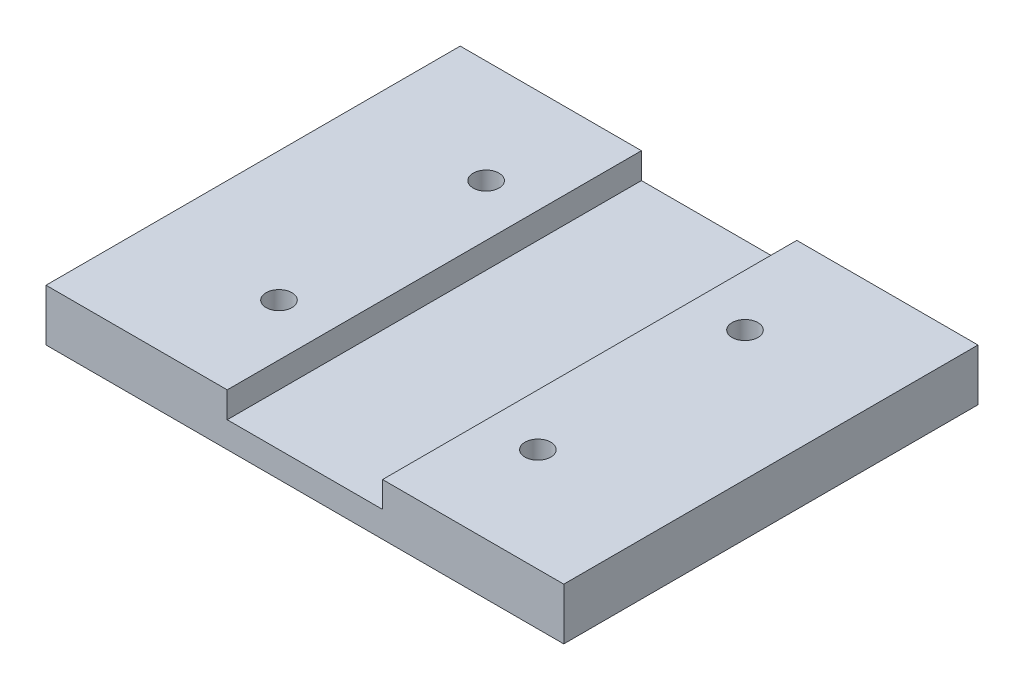
ISO-10303-21;
HEADER;
FILE_DESCRIPTION(('STEP AP214'),'2;1');
FILE_NAME('part.step','',(''),(''),'','','');
FILE_SCHEMA(('AUTOMOTIVE_DESIGN { 1 0 10303 214 1 1 1 1 }'));
ENDSEC;
DATA;
#1=APPLICATION_CONTEXT('core data for automotive mechanical design processes');
#2=APPLICATION_PROTOCOL_DEFINITION('international standard','automotive_design',2000,#1);
#3=PRODUCT_CONTEXT('',#1,'mechanical');
#4=PRODUCT('Part','Part','',(#3));
#5=PRODUCT_RELATED_PRODUCT_CATEGORY('part','',(#4));
#6=PRODUCT_DEFINITION_FORMATION('','',#4);
#7=PRODUCT_DEFINITION_CONTEXT('part definition',#1,'design');
#8=PRODUCT_DEFINITION('design','',#6,#7);
#9=PRODUCT_DEFINITION_SHAPE('','',#8);
#10=(LENGTH_UNIT() NAMED_UNIT(*) SI_UNIT(.MILLI.,.METRE.));
#11=(NAMED_UNIT(*) PLANE_ANGLE_UNIT() SI_UNIT($,.RADIAN.));
#12=(NAMED_UNIT(*) SI_UNIT($,.STERADIAN.) SOLID_ANGLE_UNIT());
#13=UNCERTAINTY_MEASURE_WITH_UNIT(LENGTH_MEASURE(1.E-05),#10,'distance_accuracy_value','');
#14=(GEOMETRIC_REPRESENTATION_CONTEXT(3) GLOBAL_UNCERTAINTY_ASSIGNED_CONTEXT((#13)) GLOBAL_UNIT_ASSIGNED_CONTEXT((#10,
#11,#12)) REPRESENTATION_CONTEXT('',''));
#15=CARTESIAN_POINT('',(0.,0.,0.));
#16=DIRECTION('',(0.,0.,1.));
#17=DIRECTION('',(1.,0.,0.));
#18=AXIS2_PLACEMENT_3D('',#15,#16,#17);
#19=CARTESIAN_POINT('',(0.,254.,0.));
#20=DIRECTION('',(0.,-1.,0.));
#21=DIRECTION('',(0.,0.,-1.));
#22=AXIS2_PLACEMENT_3D('',#19,#20,#21);
#23=PLANE('',#22);
#24=CARTESIAN_POINT('',(635.,254.,508.));
#25=DIRECTION('',(0.,1.,0.));
#26=DIRECTION('',(0.,0.,1.));
#27=AXIS2_PLACEMENT_3D('',#24,#25,#26);
#28=CIRCLE('',#27,63.5);
#29=CARTESIAN_POINT('',(635.,254.,571.5));
#30=VERTEX_POINT('',#29);
#31=EDGE_CURVE('E213',#30,#30,#28,.T.);
#32=ORIENTED_EDGE('',*,*,#31,.F.);
#33=EDGE_LOOP('',(#32));
#34=FACE_BOUND('',#33,.T.);
#35=DIRECTION('',(-1.,0.,0.));
#36=VECTOR('',#35,1.);
#37=CARTESIAN_POINT('',(-1270.,254.,-1016.));
#38=LINE('',#37,#36);
#39=CARTESIAN_POINT('',(1270.,254.,-1016.));
#40=VERTEX_POINT('',#39);
#41=CARTESIAN_POINT('',(381.,254.,-1016.));
#42=VERTEX_POINT('',#41);
#43=EDGE_CURVE('E98',#40,#42,#38,.T.);
#44=ORIENTED_EDGE('',*,*,#43,.T.);
#45=DIRECTION('',(0.,0.,1.));
#46=VECTOR('',#45,1.);
#47=CARTESIAN_POINT('',(381.,254.,-1016.));
#48=LINE('',#47,#46);
#49=CARTESIAN_POINT('',(381.,254.,1016.));
#50=VERTEX_POINT('',#49);
#51=EDGE_CURVE('E153',#42,#50,#48,.T.);
#52=ORIENTED_EDGE('',*,*,#51,.T.);
#53=DIRECTION('',(1.,0.,0.));
#54=VECTOR('',#53,1.);
#55=CARTESIAN_POINT('',(-1270.,254.,1016.));
#56=LINE('',#55,#54);
#57=CARTESIAN_POINT('',(1270.,254.,1016.));
#58=VERTEX_POINT('',#57);
#59=EDGE_CURVE('E69',#50,#58,#56,.T.);
#60=ORIENTED_EDGE('',*,*,#59,.T.);
#61=DIRECTION('',(0.,0.,-1.));
#62=VECTOR('',#61,1.);
#63=CARTESIAN_POINT('',(1270.,254.,1016.));
#64=LINE('',#63,#62);
#65=EDGE_CURVE('E156',#58,#40,#64,.T.);
#66=ORIENTED_EDGE('',*,*,#65,.T.);
#67=EDGE_LOOP('',(#44,#52,#60,#66));
#68=FACE_BOUND('',#67,.T.);
#69=CARTESIAN_POINT('',(635.,254.,-508.));
#70=DIRECTION('',(0.,1.,0.));
#71=DIRECTION('',(0.,0.,1.));
#72=AXIS2_PLACEMENT_3D('',#69,#70,#71);
#73=CIRCLE('',#72,63.5);
#74=CARTESIAN_POINT('',(635.,254.,-444.5));
#75=VERTEX_POINT('',#74);
#76=EDGE_CURVE('E222',#75,#75,#73,.T.);
#77=ORIENTED_EDGE('',*,*,#76,.F.);
#78=EDGE_LOOP('',(#77));
#79=FACE_BOUND('',#78,.T.);
#80=ADVANCED_FACE('F46',(#34,#68,#79),#23,.F.);
#81=CARTESIAN_POINT('',(0.,0.,0.));
#82=DIRECTION('',(0.,-1.,0.));
#83=DIRECTION('',(0.,0.,-1.));
#84=AXIS2_PLACEMENT_3D('',#81,#82,#83);
#85=PLANE('',#84);
#86=CARTESIAN_POINT('',(635.,0.,-508.));
#87=DIRECTION('',(0.,1.,0.));
#88=DIRECTION('',(0.,0.,1.));
#89=AXIS2_PLACEMENT_3D('',#86,#87,#88);
#90=CIRCLE('',#89,63.4999999999999);
#91=CARTESIAN_POINT('',(635.,0.,-444.5));
#92=VERTEX_POINT('',#91);
#93=EDGE_CURVE('E216',#92,#92,#90,.T.);
#94=ORIENTED_EDGE('',*,*,#93,.T.);
#95=EDGE_LOOP('',(#94));
#96=FACE_BOUND('',#95,.T.);
#97=CARTESIAN_POINT('',(635.,0.,508.));
#98=DIRECTION('',(0.,1.,0.));
#99=DIRECTION('',(0.,0.,1.));
#100=AXIS2_PLACEMENT_3D('',#97,#98,#99);
#101=CIRCLE('',#100,63.4999999999999);
#102=CARTESIAN_POINT('',(635.,0.,571.5));
#103=VERTEX_POINT('',#102);
#104=EDGE_CURVE('E215',#103,#103,#101,.T.);
#105=ORIENTED_EDGE('',*,*,#104,.T.);
#106=EDGE_LOOP('',(#105));
#107=FACE_BOUND('',#106,.T.);
#108=CARTESIAN_POINT('',(-635.,0.,508.));
#109=DIRECTION('',(0.,1.,0.));
#110=DIRECTION('',(0.,0.,1.));
#111=AXIS2_PLACEMENT_3D('',#108,#109,#110);
#112=CIRCLE('',#111,63.4999999999999);
#113=CARTESIAN_POINT('',(-635.,0.,571.5));
#114=VERTEX_POINT('',#113);
#115=EDGE_CURVE('E140',#114,#114,#112,.T.);
#116=ORIENTED_EDGE('',*,*,#115,.T.);
#117=EDGE_LOOP('',(#116));
#118=FACE_BOUND('',#117,.T.);
#119=DIRECTION('',(0.,0.,-1.));
#120=VECTOR('',#119,1.);
#121=CARTESIAN_POINT('',(1270.,0.,1016.));
#122=LINE('',#121,#120);
#123=CARTESIAN_POINT('',(1270.,0.,1016.));
#124=VERTEX_POINT('',#123);
#125=CARTESIAN_POINT('',(1270.,0.,-1016.));
#126=VERTEX_POINT('',#125);
#127=EDGE_CURVE('E152',#124,#126,#122,.T.);
#128=ORIENTED_EDGE('',*,*,#127,.F.);
#129=DIRECTION('',(1.,0.,0.));
#130=VECTOR('',#129,1.);
#131=CARTESIAN_POINT('',(-1270.,0.,1016.));
#132=LINE('',#131,#130);
#133=CARTESIAN_POINT('',(-1270.,0.,1016.));
#134=VERTEX_POINT('',#133);
#135=EDGE_CURVE('E91',#134,#124,#132,.T.);
#136=ORIENTED_EDGE('',*,*,#135,.F.);
#137=DIRECTION('',(0.,0.,1.));
#138=VECTOR('',#137,1.);
#139=CARTESIAN_POINT('',(-1270.,0.,1016.));
#140=LINE('',#139,#138);
#141=CARTESIAN_POINT('',(-1270.,0.,-1016.));
#142=VERTEX_POINT('',#141);
#143=EDGE_CURVE('E169',#142,#134,#140,.T.);
#144=ORIENTED_EDGE('',*,*,#143,.F.);
#145=DIRECTION('',(-1.,0.,0.));
#146=VECTOR('',#145,1.);
#147=CARTESIAN_POINT('',(-1270.,0.,-1016.));
#148=LINE('',#147,#146);
#149=EDGE_CURVE('E167',#126,#142,#148,.T.);
#150=ORIENTED_EDGE('',*,*,#149,.F.);
#151=EDGE_LOOP('',(#128,#136,#144,#150));
#152=FACE_BOUND('',#151,.T.);
#153=CARTESIAN_POINT('',(-635.,0.,-508.));
#154=DIRECTION('',(0.,1.,0.));
#155=DIRECTION('',(0.,0.,1.));
#156=AXIS2_PLACEMENT_3D('',#153,#154,#155);
#157=CIRCLE('',#156,63.4999999999999);
#158=CARTESIAN_POINT('',(-635.,0.,-444.5));
#159=VERTEX_POINT('',#158);
#160=EDGE_CURVE('E228',#159,#159,#157,.T.);
#161=ORIENTED_EDGE('',*,*,#160,.T.);
#162=EDGE_LOOP('',(#161));
#163=FACE_BOUND('',#162,.T.);
#164=ADVANCED_FACE('F184',(#96,#107,#118,#152,#163),#85,.T.);
#165=CARTESIAN_POINT('',(-635.,254.,-508.));
#166=DIRECTION('',(0.,1.,0.));
#167=DIRECTION('',(0.,0.,1.));
#168=AXIS2_PLACEMENT_3D('',#165,#166,#167);
#169=CIRCLE('',#168,63.5);
#170=CARTESIAN_POINT('',(-635.,254.,-444.5));
#171=VERTEX_POINT('',#170);
#172=EDGE_CURVE('E219',#171,#171,#169,.T.);
#173=ORIENTED_EDGE('',*,*,#172,.F.);
#174=EDGE_LOOP('',(#173));
#175=FACE_BOUND('',#174,.T.);
#176=CARTESIAN_POINT('',(-635.,254.,508.));
#177=DIRECTION('',(0.,1.,0.));
#178=DIRECTION('',(0.,0.,1.));
#179=AXIS2_PLACEMENT_3D('',#176,#177,#178);
#180=CIRCLE('',#179,63.5);
#181=CARTESIAN_POINT('',(-635.,254.,571.5));
#182=VERTEX_POINT('',#181);
#183=EDGE_CURVE('E231',#182,#182,#180,.T.);
#184=ORIENTED_EDGE('',*,*,#183,.F.);
#185=EDGE_LOOP('',(#184));
#186=FACE_BOUND('',#185,.T.);
#187=CARTESIAN_POINT('',(-1270.,254.,1016.));
#188=VERTEX_POINT('',#187);
#189=CARTESIAN_POINT('',(-381.,254.,1016.));
#190=VERTEX_POINT('',#189);
#191=EDGE_CURVE('E162',#188,#190,#56,.T.);
#192=ORIENTED_EDGE('',*,*,#191,.T.);
#193=DIRECTION('',(0.,0.,1.));
#194=VECTOR('',#193,1.);
#195=CARTESIAN_POINT('',(-381.,254.,-1016.));
#196=LINE('',#195,#194);
#197=CARTESIAN_POINT('',(-381.,254.,-1016.));
#198=VERTEX_POINT('',#197);
#199=EDGE_CURVE('E137',#198,#190,#196,.T.);
#200=ORIENTED_EDGE('',*,*,#199,.F.);
#201=CARTESIAN_POINT('',(-1270.,254.,-1016.));
#202=VERTEX_POINT('',#201);
#203=EDGE_CURVE('E158',#198,#202,#38,.T.);
#204=ORIENTED_EDGE('',*,*,#203,.T.);
#205=DIRECTION('',(0.,0.,1.));
#206=VECTOR('',#205,1.);
#207=CARTESIAN_POINT('',(-1270.,254.,1016.));
#208=LINE('',#207,#206);
#209=EDGE_CURVE('E160',#202,#188,#208,.T.);
#210=ORIENTED_EDGE('',*,*,#209,.T.);
#211=EDGE_LOOP('',(#192,#200,#204,#210));
#212=FACE_BOUND('',#211,.T.);
#213=ADVANCED_FACE('F194',(#175,#186,#212),#23,.F.);
#214=CARTESIAN_POINT('',(1270.,254.,1016.));
#215=DIRECTION('',(-1.,0.,0.));
#216=DIRECTION('',(0.,0.,1.));
#217=AXIS2_PLACEMENT_3D('',#214,#215,#216);
#218=PLANE('',#217);
#219=ORIENTED_EDGE('',*,*,#127,.T.);
#220=DIRECTION('',(0.,-1.,0.));
#221=VECTOR('',#220,1.);
#222=CARTESIAN_POINT('',(1270.,254.,-1016.));
#223=LINE('',#222,#221);
#224=EDGE_CURVE('E13',#40,#126,#223,.T.);
#225=ORIENTED_EDGE('',*,*,#224,.F.);
#226=ORIENTED_EDGE('',*,*,#65,.F.);
#227=DIRECTION('',(0.,-1.,0.));
#228=VECTOR('',#227,1.);
#229=CARTESIAN_POINT('',(1270.,254.,1016.));
#230=LINE('',#229,#228);
#231=EDGE_CURVE('E164',#58,#124,#230,.T.);
#232=ORIENTED_EDGE('',*,*,#231,.T.);
#233=EDGE_LOOP('',(#219,#225,#226,#232));
#234=FACE_BOUND('',#233,.T.);
#235=ADVANCED_FACE('F48',(#234),#218,.F.);
#236=CARTESIAN_POINT('',(-1270.,254.,-1016.));
#237=DIRECTION('',(0.,0.,1.));
#238=DIRECTION('',(1.,0.,0.));
#239=AXIS2_PLACEMENT_3D('',#236,#237,#238);
#240=PLANE('',#239);
#241=ORIENTED_EDGE('',*,*,#203,.F.);
#242=DIRECTION('',(0.,-1.,0.));
#243=VECTOR('',#242,1.);
#244=CARTESIAN_POINT('',(-381.,254.,-1016.));
#245=LINE('',#244,#243);
#246=CARTESIAN_POINT('',(-381.,127.,-1016.));
#247=VERTEX_POINT('',#246);
#248=EDGE_CURVE('E144',#198,#247,#245,.T.);
#249=ORIENTED_EDGE('',*,*,#248,.T.);
#250=DIRECTION('',(1.,0.,0.));
#251=VECTOR('',#250,1.);
#252=CARTESIAN_POINT('',(-381.,127.,-1016.));
#253=LINE('',#252,#251);
#254=CARTESIAN_POINT('',(381.,127.,-1016.));
#255=VERTEX_POINT('',#254);
#256=EDGE_CURVE('E127',#247,#255,#253,.T.);
#257=ORIENTED_EDGE('',*,*,#256,.T.);
#258=DIRECTION('',(0.,1.,0.));
#259=VECTOR('',#258,1.);
#260=CARTESIAN_POINT('',(381.,127.,-1016.));
#261=LINE('',#260,#259);
#262=EDGE_CURVE('E131',#255,#42,#261,.T.);
#263=ORIENTED_EDGE('',*,*,#262,.T.);
#264=ORIENTED_EDGE('',*,*,#43,.F.);
#265=ORIENTED_EDGE('',*,*,#224,.T.);
#266=ORIENTED_EDGE('',*,*,#149,.T.);
#267=DIRECTION('',(0.,-1.,0.));
#268=VECTOR('',#267,1.);
#269=CARTESIAN_POINT('',(-1270.,254.,-1016.));
#270=LINE('',#269,#268);
#271=EDGE_CURVE('E54',#202,#142,#270,.T.);
#272=ORIENTED_EDGE('',*,*,#271,.F.);
#273=EDGE_LOOP('',(#241,#249,#257,#263,#264,#265,#266,#272));
#274=FACE_BOUND('',#273,.T.);
#275=ADVANCED_FACE('F192',(#274),#240,.F.);
#276=CARTESIAN_POINT('',(-1270.,254.,1016.));
#277=DIRECTION('',(1.,0.,0.));
#278=DIRECTION('',(0.,0.,-1.));
#279=AXIS2_PLACEMENT_3D('',#276,#277,#278);
#280=PLANE('',#279);
#281=ORIENTED_EDGE('',*,*,#143,.T.);
#282=DIRECTION('',(0.,-1.,0.));
#283=VECTOR('',#282,1.);
#284=CARTESIAN_POINT('',(-1270.,254.,1016.));
#285=LINE('',#284,#283);
#286=EDGE_CURVE('E173',#188,#134,#285,.T.);
#287=ORIENTED_EDGE('',*,*,#286,.F.);
#288=ORIENTED_EDGE('',*,*,#209,.F.);
#289=ORIENTED_EDGE('',*,*,#271,.T.);
#290=EDGE_LOOP('',(#281,#287,#288,#289));
#291=FACE_BOUND('',#290,.T.);
#292=ADVANCED_FACE('F179',(#291),#280,.F.);
#293=CARTESIAN_POINT('',(-1270.,254.,1016.));
#294=DIRECTION('',(0.,0.,-1.));
#295=DIRECTION('',(-1.,0.,0.));
#296=AXIS2_PLACEMENT_3D('',#293,#294,#295);
#297=PLANE('',#296);
#298=DIRECTION('',(1.,0.,0.));
#299=VECTOR('',#298,1.);
#300=CARTESIAN_POINT('',(-381.,127.,1016.));
#301=LINE('',#300,#299);
#302=CARTESIAN_POINT('',(-381.,127.,1016.));
#303=VERTEX_POINT('',#302);
#304=CARTESIAN_POINT('',(381.,127.,1016.));
#305=VERTEX_POINT('',#304);
#306=EDGE_CURVE('E125',#303,#305,#301,.T.);
#307=ORIENTED_EDGE('',*,*,#306,.F.);
#308=DIRECTION('',(0.,-1.,0.));
#309=VECTOR('',#308,1.);
#310=CARTESIAN_POINT('',(-381.,254.,1016.));
#311=LINE('',#310,#309);
#312=EDGE_CURVE('E134',#190,#303,#311,.T.);
#313=ORIENTED_EDGE('',*,*,#312,.F.);
#314=ORIENTED_EDGE('',*,*,#191,.F.);
#315=ORIENTED_EDGE('',*,*,#286,.T.);
#316=ORIENTED_EDGE('',*,*,#135,.T.);
#317=ORIENTED_EDGE('',*,*,#231,.F.);
#318=ORIENTED_EDGE('',*,*,#59,.F.);
#319=DIRECTION('',(0.,1.,0.));
#320=VECTOR('',#319,1.);
#321=CARTESIAN_POINT('',(381.,127.,1016.));
#322=LINE('',#321,#320);
#323=EDGE_CURVE('E61',#305,#50,#322,.T.);
#324=ORIENTED_EDGE('',*,*,#323,.F.);
#325=EDGE_LOOP('',(#307,#313,#314,#315,#316,#317,#318,#324));
#326=FACE_BOUND('',#325,.T.);
#327=ADVANCED_FACE('F142',(#326),#297,.F.);
#328=CARTESIAN_POINT('',(-381.,254.,-1016.));
#329=DIRECTION('',(-1.,0.,0.));
#330=DIRECTION('',(0.,0.,1.));
#331=AXIS2_PLACEMENT_3D('',#328,#329,#330);
#332=PLANE('',#331);
#333=DIRECTION('',(0.,0.,1.));
#334=VECTOR('',#333,1.);
#335=CARTESIAN_POINT('',(-381.,127.,-1016.));
#336=LINE('',#335,#334);
#337=EDGE_CURVE('E121',#247,#303,#336,.T.);
#338=ORIENTED_EDGE('',*,*,#337,.F.);
#339=ORIENTED_EDGE('',*,*,#248,.F.);
#340=ORIENTED_EDGE('',*,*,#199,.T.);
#341=ORIENTED_EDGE('',*,*,#312,.T.);
#342=EDGE_LOOP('',(#338,#339,#340,#341));
#343=FACE_BOUND('',#342,.T.);
#344=ADVANCED_FACE('F135',(#343),#332,.F.);
#345=CARTESIAN_POINT('',(381.,127.,-1016.));
#346=DIRECTION('',(1.,0.,0.));
#347=DIRECTION('',(0.,0.,-1.));
#348=AXIS2_PLACEMENT_3D('',#345,#346,#347);
#349=PLANE('',#348);
#350=ORIENTED_EDGE('',*,*,#51,.F.);
#351=ORIENTED_EDGE('',*,*,#262,.F.);
#352=DIRECTION('',(0.,0.,1.));
#353=VECTOR('',#352,1.);
#354=CARTESIAN_POINT('',(381.,127.,-1016.));
#355=LINE('',#354,#353);
#356=EDGE_CURVE('E130',#255,#305,#355,.T.);
#357=ORIENTED_EDGE('',*,*,#356,.T.);
#358=ORIENTED_EDGE('',*,*,#323,.T.);
#359=EDGE_LOOP('',(#350,#351,#357,#358));
#360=FACE_BOUND('',#359,.T.);
#361=ADVANCED_FACE('F191',(#360),#349,.F.);
#362=CARTESIAN_POINT('',(-381.,127.,-1016.));
#363=DIRECTION('',(0.,-1.,0.));
#364=DIRECTION('',(1.,0.,0.));
#365=AXIS2_PLACEMENT_3D('',#362,#363,#364);
#366=PLANE('',#365);
#367=ORIENTED_EDGE('',*,*,#356,.F.);
#368=ORIENTED_EDGE('',*,*,#256,.F.);
#369=ORIENTED_EDGE('',*,*,#337,.T.);
#370=ORIENTED_EDGE('',*,*,#306,.T.);
#371=EDGE_LOOP('',(#367,#368,#369,#370));
#372=FACE_BOUND('',#371,.T.);
#373=ADVANCED_FACE('F123',(#372),#366,.F.);
#374=CARTESIAN_POINT('',(-635.,254.,508.));
#375=DIRECTION('',(0.,1.,0.));
#376=DIRECTION('',(0.,0.,1.));
#377=AXIS2_PLACEMENT_3D('',#374,#375,#376);
#378=CYLINDRICAL_SURFACE('',#377,63.4999999999999);
#379=ORIENTED_EDGE('',*,*,#115,.F.);
#380=EDGE_LOOP('',(#379));
#381=FACE_BOUND('',#380,.T.);
#382=ORIENTED_EDGE('',*,*,#183,.T.);
#383=EDGE_LOOP('',(#382));
#384=FACE_BOUND('',#383,.T.);
#385=ADVANCED_FACE('F237',(#381,#384),#378,.F.);
#386=CARTESIAN_POINT('',(-635.,254.,-508.));
#387=DIRECTION('',(0.,1.,0.));
#388=DIRECTION('',(0.,0.,1.));
#389=AXIS2_PLACEMENT_3D('',#386,#387,#388);
#390=CYLINDRICAL_SURFACE('',#389,63.4999999999999);
#391=ORIENTED_EDGE('',*,*,#160,.F.);
#392=EDGE_LOOP('',(#391));
#393=FACE_BOUND('',#392,.T.);
#394=ORIENTED_EDGE('',*,*,#172,.T.);
#395=EDGE_LOOP('',(#394));
#396=FACE_BOUND('',#395,.T.);
#397=ADVANCED_FACE('F240',(#393,#396),#390,.F.);
#398=CARTESIAN_POINT('',(635.,254.,508.));
#399=DIRECTION('',(0.,1.,0.));
#400=DIRECTION('',(0.,0.,1.));
#401=AXIS2_PLACEMENT_3D('',#398,#399,#400);
#402=CYLINDRICAL_SURFACE('',#401,63.4999999999999);
#403=ORIENTED_EDGE('',*,*,#104,.F.);
#404=EDGE_LOOP('',(#403));
#405=FACE_BOUND('',#404,.T.);
#406=ORIENTED_EDGE('',*,*,#31,.T.);
#407=EDGE_LOOP('',(#406));
#408=FACE_BOUND('',#407,.T.);
#409=ADVANCED_FACE('F247',(#405,#408),#402,.F.);
#410=CARTESIAN_POINT('',(635.,254.,-508.));
#411=DIRECTION('',(0.,1.,0.));
#412=DIRECTION('',(0.,0.,1.));
#413=AXIS2_PLACEMENT_3D('',#410,#411,#412);
#414=CYLINDRICAL_SURFACE('',#413,63.4999999999999);
#415=ORIENTED_EDGE('',*,*,#93,.F.);
#416=EDGE_LOOP('',(#415));
#417=FACE_BOUND('',#416,.T.);
#418=ORIENTED_EDGE('',*,*,#76,.T.);
#419=EDGE_LOOP('',(#418));
#420=FACE_BOUND('',#419,.T.);
#421=ADVANCED_FACE('F305',(#417,#420),#414,.F.);
#422=CLOSED_SHELL('',(#80,#164,#213,#235,#275,#292,#327,#344,#361,#373,#385,#397,#409,#421));
#423=MANIFOLD_SOLID_BREP('B2',#422);
#424=ADVANCED_BREP_SHAPE_REPRESENTATION('',(#18,#423),#14);
#425=SHAPE_DEFINITION_REPRESENTATION(#9,#424);
ENDSEC;
END-ISO-10303-21;
